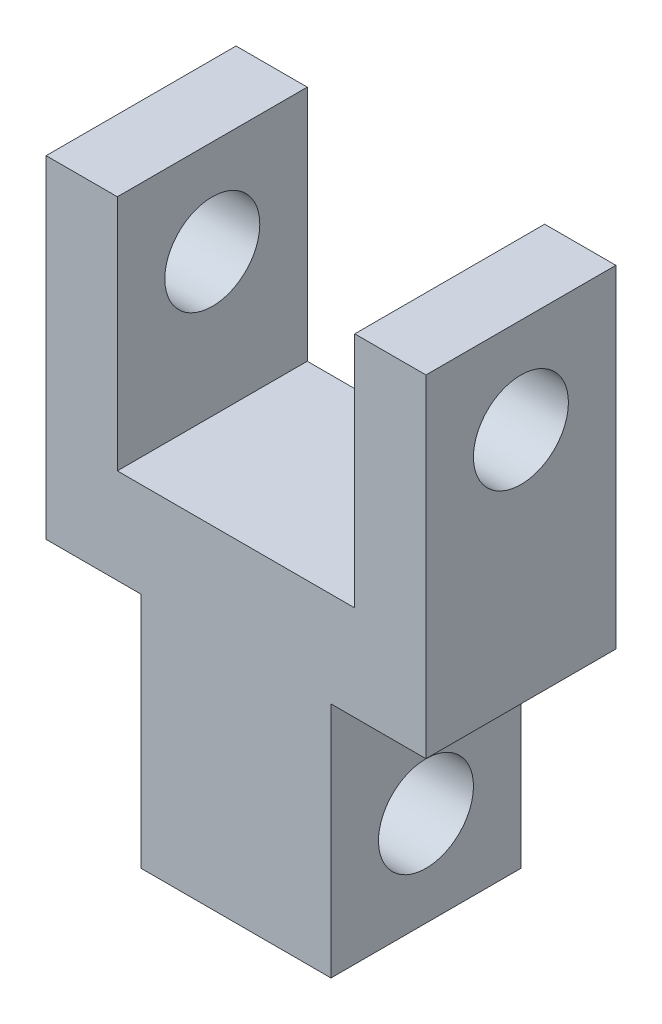
ISO-10303-21;
HEADER;
FILE_DESCRIPTION(('STEP AP214'),'2;1');
FILE_NAME('part.step','',(''),(''),'','','');
FILE_SCHEMA(('AUTOMOTIVE_DESIGN { 1 0 10303 214 1 1 1 1 }'));
ENDSEC;
DATA;
#1=APPLICATION_CONTEXT('core data for automotive mechanical design processes');
#2=APPLICATION_PROTOCOL_DEFINITION('international standard','automotive_design',2000,#1);
#3=PRODUCT_CONTEXT('',#1,'mechanical');
#4=PRODUCT('Part','Part','',(#3));
#5=PRODUCT_RELATED_PRODUCT_CATEGORY('part','',(#4));
#6=PRODUCT_DEFINITION_FORMATION('','',#4);
#7=PRODUCT_DEFINITION_CONTEXT('part definition',#1,'design');
#8=PRODUCT_DEFINITION('design','',#6,#7);
#9=PRODUCT_DEFINITION_SHAPE('','',#8);
#10=(LENGTH_UNIT() NAMED_UNIT(*) SI_UNIT(.MILLI.,.METRE.));
#11=(NAMED_UNIT(*) PLANE_ANGLE_UNIT() SI_UNIT($,.RADIAN.));
#12=(NAMED_UNIT(*) SI_UNIT($,.STERADIAN.) SOLID_ANGLE_UNIT());
#13=UNCERTAINTY_MEASURE_WITH_UNIT(LENGTH_MEASURE(1.E-05),#10,'distance_accuracy_value','');
#14=(GEOMETRIC_REPRESENTATION_CONTEXT(3) GLOBAL_UNCERTAINTY_ASSIGNED_CONTEXT((#13)) GLOBAL_UNIT_ASSIGNED_CONTEXT((#10,
#11,#12)) REPRESENTATION_CONTEXT('',''));
#15=CARTESIAN_POINT('',(0.,0.,0.));
#16=DIRECTION('',(0.,0.,1.));
#17=DIRECTION('',(1.,0.,0.));
#18=AXIS2_PLACEMENT_3D('',#15,#16,#17);
#19=CARTESIAN_POINT('',(-12.7,38.1,6.35));
#20=DIRECTION('',(0.,-1.,0.));
#21=DIRECTION('',(1.,0.,0.));
#22=AXIS2_PLACEMENT_3D('',#19,#20,#21);
#23=PLANE('',#22);
#24=DIRECTION('',(-1.,0.,0.));
#25=VECTOR('',#24,1.);
#26=CARTESIAN_POINT('',(-12.7,38.1,-6.35));
#27=LINE('',#26,#25);
#28=CARTESIAN_POINT('',(-7.9375,38.1,-6.35));
#29=VERTEX_POINT('',#28);
#30=CARTESIAN_POINT('',(-12.7,38.1,-6.35));
#31=VERTEX_POINT('',#30);
#32=EDGE_CURVE('E154',#29,#31,#27,.T.);
#33=ORIENTED_EDGE('',*,*,#32,.T.);
#34=DIRECTION('',(0.,0.,-1.));
#35=VECTOR('',#34,1.);
#36=CARTESIAN_POINT('',(-12.7,38.1,6.35));
#37=LINE('',#36,#35);
#38=CARTESIAN_POINT('',(-12.7,38.1,6.35));
#39=VERTEX_POINT('',#38);
#40=EDGE_CURVE('E11',#39,#31,#37,.T.);
#41=ORIENTED_EDGE('',*,*,#40,.F.);
#42=DIRECTION('',(-1.,0.,0.));
#43=VECTOR('',#42,1.);
#44=CARTESIAN_POINT('',(-12.7,38.1,6.35));
#45=LINE('',#44,#43);
#46=CARTESIAN_POINT('',(-7.9375,38.1,6.35));
#47=VERTEX_POINT('',#46);
#48=EDGE_CURVE('E177',#47,#39,#45,.T.);
#49=ORIENTED_EDGE('',*,*,#48,.F.);
#50=DIRECTION('',(0.,0.,-1.));
#51=VECTOR('',#50,1.);
#52=CARTESIAN_POINT('',(-7.9375,38.1,6.35));
#53=LINE('',#52,#51);
#54=EDGE_CURVE('E150',#47,#29,#53,.T.);
#55=ORIENTED_EDGE('',*,*,#54,.T.);
#56=EDGE_LOOP('',(#33,#41,#49,#55));
#57=FACE_BOUND('',#56,.T.);
#58=ADVANCED_FACE('F33',(#57),#23,.F.);
#59=CARTESIAN_POINT('',(-12.7,38.1,6.35));
#60=DIRECTION('',(1.,0.,0.));
#61=DIRECTION('',(0.,1.,0.));
#62=AXIS2_PLACEMENT_3D('',#59,#60,#61);
#63=PLANE('',#62);
#64=CARTESIAN_POINT('',(-12.7,31.75,0.));
#65=DIRECTION('',(1.,0.,0.));
#66=DIRECTION('',(0.,1.,0.));
#67=AXIS2_PLACEMENT_3D('',#64,#65,#66);
#68=CIRCLE('',#67,3.175);
#69=CARTESIAN_POINT('',(-12.7,34.925,0.));
#70=VERTEX_POINT('',#69);
#71=EDGE_CURVE('E295',#70,#70,#68,.T.);
#72=ORIENTED_EDGE('',*,*,#71,.T.);
#73=EDGE_LOOP('',(#72));
#74=FACE_BOUND('',#73,.T.);
#75=DIRECTION('',(0.,-1.,0.));
#76=VECTOR('',#75,1.);
#77=CARTESIAN_POINT('',(-12.7,38.1,-6.35));
#78=LINE('',#77,#76);
#79=CARTESIAN_POINT('',(-12.7,15.875,-6.35));
#80=VERTEX_POINT('',#79);
#81=EDGE_CURVE('E157',#31,#80,#78,.T.);
#82=ORIENTED_EDGE('',*,*,#81,.T.);
#83=DIRECTION('',(0.,0.,-1.));
#84=VECTOR('',#83,1.);
#85=CARTESIAN_POINT('',(-12.7,15.875,6.35));
#86=LINE('',#85,#84);
#87=CARTESIAN_POINT('',(-12.7,15.875,6.35));
#88=VERTEX_POINT('',#87);
#89=EDGE_CURVE('E42',#88,#80,#86,.T.);
#90=ORIENTED_EDGE('',*,*,#89,.F.);
#91=DIRECTION('',(0.,-1.,0.));
#92=VECTOR('',#91,1.);
#93=CARTESIAN_POINT('',(-12.7,38.1,6.35));
#94=LINE('',#93,#92);
#95=EDGE_CURVE('E105',#39,#88,#94,.T.);
#96=ORIENTED_EDGE('',*,*,#95,.F.);
#97=ORIENTED_EDGE('',*,*,#40,.T.);
#98=EDGE_LOOP('',(#82,#90,#96,#97));
#99=FACE_BOUND('',#98,.T.);
#100=ADVANCED_FACE('F258',(#74,#99),#63,.F.);
#101=CARTESIAN_POINT('',(-12.7,15.875,6.35));
#102=DIRECTION('',(0.,1.,0.));
#103=DIRECTION('',(0.,0.,1.));
#104=AXIS2_PLACEMENT_3D('',#101,#102,#103);
#105=PLANE('',#104);
#106=DIRECTION('',(1.,0.,0.));
#107=VECTOR('',#106,1.);
#108=CARTESIAN_POINT('',(-12.7,15.875,-6.35));
#109=LINE('',#108,#107);
#110=CARTESIAN_POINT('',(-6.35,15.875,-6.35));
#111=VERTEX_POINT('',#110);
#112=EDGE_CURVE('E160',#80,#111,#109,.T.);
#113=ORIENTED_EDGE('',*,*,#112,.T.);
#114=DIRECTION('',(0.,0.,-1.));
#115=VECTOR('',#114,1.);
#116=CARTESIAN_POINT('',(-6.35,15.875,6.35));
#117=LINE('',#116,#115);
#118=CARTESIAN_POINT('',(-6.35,15.875,6.35));
#119=VERTEX_POINT('',#118);
#120=EDGE_CURVE('E196',#119,#111,#117,.T.);
#121=ORIENTED_EDGE('',*,*,#120,.F.);
#122=DIRECTION('',(1.,0.,0.));
#123=VECTOR('',#122,1.);
#124=CARTESIAN_POINT('',(-12.7,15.875,6.35));
#125=LINE('',#124,#123);
#126=EDGE_CURVE('E205',#88,#119,#125,.T.);
#127=ORIENTED_EDGE('',*,*,#126,.F.);
#128=ORIENTED_EDGE('',*,*,#89,.T.);
#129=EDGE_LOOP('',(#113,#121,#127,#128));
#130=FACE_BOUND('',#129,.T.);
#131=ADVANCED_FACE('F203',(#130),#105,.F.);
#132=CARTESIAN_POINT('',(-6.35,15.875,6.35));
#133=DIRECTION('',(1.,0.,0.));
#134=DIRECTION('',(0.,1.,0.));
#135=AXIS2_PLACEMENT_3D('',#132,#133,#134);
#136=PLANE('',#135);
#137=CARTESIAN_POINT('',(-6.35,6.35,0.));
#138=DIRECTION('',(1.,0.,0.));
#139=DIRECTION('',(0.,1.,0.));
#140=AXIS2_PLACEMENT_3D('',#137,#138,#139);
#141=CIRCLE('',#140,3.175);
#142=CARTESIAN_POINT('',(-6.35,9.525,0.));
#143=VERTEX_POINT('',#142);
#144=EDGE_CURVE('E302',#143,#143,#141,.T.);
#145=ORIENTED_EDGE('',*,*,#144,.T.);
#146=EDGE_LOOP('',(#145));
#147=FACE_BOUND('',#146,.T.);
#148=DIRECTION('',(0.,-1.,0.));
#149=VECTOR('',#148,1.);
#150=CARTESIAN_POINT('',(-6.35,15.875,-6.35));
#151=LINE('',#150,#149);
#152=CARTESIAN_POINT('',(-6.35,0.,-6.35));
#153=VERTEX_POINT('',#152);
#154=EDGE_CURVE('E162',#111,#153,#151,.T.);
#155=ORIENTED_EDGE('',*,*,#154,.T.);
#156=DIRECTION('',(0.,0.,-1.));
#157=VECTOR('',#156,1.);
#158=CARTESIAN_POINT('',(-6.35,0.,6.35));
#159=LINE('',#158,#157);
#160=CARTESIAN_POINT('',(-6.35,0.,6.35));
#161=VERTEX_POINT('',#160);
#162=EDGE_CURVE('E193',#161,#153,#159,.T.);
#163=ORIENTED_EDGE('',*,*,#162,.F.);
#164=DIRECTION('',(0.,-1.,0.));
#165=VECTOR('',#164,1.);
#166=CARTESIAN_POINT('',(-6.35,15.875,6.35));
#167=LINE('',#166,#165);
#168=EDGE_CURVE('E223',#119,#161,#167,.T.);
#169=ORIENTED_EDGE('',*,*,#168,.F.);
#170=ORIENTED_EDGE('',*,*,#120,.T.);
#171=EDGE_LOOP('',(#155,#163,#169,#170));
#172=FACE_BOUND('',#171,.T.);
#173=ADVANCED_FACE('F214',(#147,#172),#136,.F.);
#174=CARTESIAN_POINT('',(-6.35,0.,6.35));
#175=DIRECTION('',(0.,1.,0.));
#176=DIRECTION('',(0.,0.,1.));
#177=AXIS2_PLACEMENT_3D('',#174,#175,#176);
#178=PLANE('',#177);
#179=DIRECTION('',(1.,0.,0.));
#180=VECTOR('',#179,1.);
#181=CARTESIAN_POINT('',(-6.35,0.,-6.35));
#182=LINE('',#181,#180);
#183=CARTESIAN_POINT('',(6.35,0.,-6.35));
#184=VERTEX_POINT('',#183);
#185=EDGE_CURVE('E164',#153,#184,#182,.T.);
#186=ORIENTED_EDGE('',*,*,#185,.T.);
#187=DIRECTION('',(0.,0.,-1.));
#188=VECTOR('',#187,1.);
#189=CARTESIAN_POINT('',(6.35,0.,6.35));
#190=LINE('',#189,#188);
#191=CARTESIAN_POINT('',(6.35,0.,6.35));
#192=VERTEX_POINT('',#191);
#193=EDGE_CURVE('E190',#192,#184,#190,.T.);
#194=ORIENTED_EDGE('',*,*,#193,.F.);
#195=DIRECTION('',(1.,0.,0.));
#196=VECTOR('',#195,1.);
#197=CARTESIAN_POINT('',(-6.35,0.,6.35));
#198=LINE('',#197,#196);
#199=EDGE_CURVE('E220',#161,#192,#198,.T.);
#200=ORIENTED_EDGE('',*,*,#199,.F.);
#201=ORIENTED_EDGE('',*,*,#162,.T.);
#202=EDGE_LOOP('',(#186,#194,#200,#201));
#203=FACE_BOUND('',#202,.T.);
#204=ADVANCED_FACE('F218',(#203),#178,.F.);
#205=CARTESIAN_POINT('',(6.35,15.875,6.35));
#206=DIRECTION('',(-1.,0.,0.));
#207=DIRECTION('',(0.,-1.,0.));
#208=AXIS2_PLACEMENT_3D('',#205,#206,#207);
#209=PLANE('',#208);
#210=CARTESIAN_POINT('',(6.35,6.35,0.));
#211=DIRECTION('',(1.,0.,0.));
#212=DIRECTION('',(0.,1.,0.));
#213=AXIS2_PLACEMENT_3D('',#210,#211,#212);
#214=CIRCLE('',#213,3.175);
#215=CARTESIAN_POINT('',(6.35,9.525,0.));
#216=VERTEX_POINT('',#215);
#217=EDGE_CURVE('E306',#216,#216,#214,.T.);
#218=ORIENTED_EDGE('',*,*,#217,.F.);
#219=EDGE_LOOP('',(#218));
#220=FACE_BOUND('',#219,.T.);
#221=DIRECTION('',(0.,1.,0.));
#222=VECTOR('',#221,1.);
#223=CARTESIAN_POINT('',(6.35,15.875,-6.35));
#224=LINE('',#223,#222);
#225=CARTESIAN_POINT('',(6.35,15.875,-6.35));
#226=VERTEX_POINT('',#225);
#227=EDGE_CURVE('E166',#184,#226,#224,.T.);
#228=ORIENTED_EDGE('',*,*,#227,.T.);
#229=DIRECTION('',(0.,0.,-1.));
#230=VECTOR('',#229,1.);
#231=CARTESIAN_POINT('',(6.35,15.875,6.35));
#232=LINE('',#231,#230);
#233=CARTESIAN_POINT('',(6.35,15.875,6.35));
#234=VERTEX_POINT('',#233);
#235=EDGE_CURVE('E187',#234,#226,#232,.T.);
#236=ORIENTED_EDGE('',*,*,#235,.F.);
#237=DIRECTION('',(0.,1.,0.));
#238=VECTOR('',#237,1.);
#239=CARTESIAN_POINT('',(6.35,15.875,6.35));
#240=LINE('',#239,#238);
#241=EDGE_CURVE('E222',#192,#234,#240,.T.);
#242=ORIENTED_EDGE('',*,*,#241,.F.);
#243=ORIENTED_EDGE('',*,*,#193,.T.);
#244=EDGE_LOOP('',(#228,#236,#242,#243));
#245=FACE_BOUND('',#244,.T.);
#246=ADVANCED_FACE('F274',(#220,#245),#209,.F.);
#247=CARTESIAN_POINT('',(12.7,15.875,6.35));
#248=DIRECTION('',(0.,1.,0.));
#249=DIRECTION('',(-1.,0.,0.));
#250=AXIS2_PLACEMENT_3D('',#247,#248,#249);
#251=PLANE('',#250);
#252=DIRECTION('',(1.,0.,0.));
#253=VECTOR('',#252,1.);
#254=CARTESIAN_POINT('',(12.7,15.875,-6.35));
#255=LINE('',#254,#253);
#256=CARTESIAN_POINT('',(12.7,15.875,-6.35));
#257=VERTEX_POINT('',#256);
#258=EDGE_CURVE('E168',#226,#257,#255,.T.);
#259=ORIENTED_EDGE('',*,*,#258,.T.);
#260=DIRECTION('',(0.,0.,-1.));
#261=VECTOR('',#260,1.);
#262=CARTESIAN_POINT('',(12.7,15.875,6.35));
#263=LINE('',#262,#261);
#264=CARTESIAN_POINT('',(12.7,15.875,6.35));
#265=VERTEX_POINT('',#264);
#266=EDGE_CURVE('E184',#265,#257,#263,.T.);
#267=ORIENTED_EDGE('',*,*,#266,.F.);
#268=DIRECTION('',(1.,0.,0.));
#269=VECTOR('',#268,1.);
#270=CARTESIAN_POINT('',(12.7,15.875,6.35));
#271=LINE('',#270,#269);
#272=EDGE_CURVE('E225',#234,#265,#271,.T.);
#273=ORIENTED_EDGE('',*,*,#272,.F.);
#274=ORIENTED_EDGE('',*,*,#235,.T.);
#275=EDGE_LOOP('',(#259,#267,#273,#274));
#276=FACE_BOUND('',#275,.T.);
#277=ADVANCED_FACE('F277',(#276),#251,.F.);
#278=CARTESIAN_POINT('',(12.7,38.1,6.35));
#279=DIRECTION('',(-1.,0.,0.));
#280=DIRECTION('',(0.,-1.,0.));
#281=AXIS2_PLACEMENT_3D('',#278,#279,#280);
#282=PLANE('',#281);
#283=CARTESIAN_POINT('',(12.7,31.75,0.));
#284=DIRECTION('',(1.,0.,0.));
#285=DIRECTION('',(0.,1.,0.));
#286=AXIS2_PLACEMENT_3D('',#283,#284,#285);
#287=CIRCLE('',#286,3.175);
#288=CARTESIAN_POINT('',(12.7,34.925,0.));
#289=VERTEX_POINT('',#288);
#290=EDGE_CURVE('E298',#289,#289,#287,.T.);
#291=ORIENTED_EDGE('',*,*,#290,.F.);
#292=EDGE_LOOP('',(#291));
#293=FACE_BOUND('',#292,.T.);
#294=DIRECTION('',(0.,1.,0.));
#295=VECTOR('',#294,1.);
#296=CARTESIAN_POINT('',(12.7,38.1,-6.35));
#297=LINE('',#296,#295);
#298=CARTESIAN_POINT('',(12.7,38.1,-6.35));
#299=VERTEX_POINT('',#298);
#300=EDGE_CURVE('E170',#257,#299,#297,.T.);
#301=ORIENTED_EDGE('',*,*,#300,.T.);
#302=DIRECTION('',(0.,0.,-1.));
#303=VECTOR('',#302,1.);
#304=CARTESIAN_POINT('',(12.7,38.1,6.35));
#305=LINE('',#304,#303);
#306=CARTESIAN_POINT('',(12.7,38.1,6.35));
#307=VERTEX_POINT('',#306);
#308=EDGE_CURVE('E181',#307,#299,#305,.T.);
#309=ORIENTED_EDGE('',*,*,#308,.F.);
#310=DIRECTION('',(0.,1.,0.));
#311=VECTOR('',#310,1.);
#312=CARTESIAN_POINT('',(12.7,38.1,6.35));
#313=LINE('',#312,#311);
#314=EDGE_CURVE('E231',#265,#307,#313,.T.);
#315=ORIENTED_EDGE('',*,*,#314,.F.);
#316=ORIENTED_EDGE('',*,*,#266,.T.);
#317=EDGE_LOOP('',(#301,#309,#315,#316));
#318=FACE_BOUND('',#317,.T.);
#319=ADVANCED_FACE('F237',(#293,#318),#282,.F.);
#320=CARTESIAN_POINT('',(12.7,38.1,6.35));
#321=DIRECTION('',(0.,-1.,0.));
#322=DIRECTION('',(1.,0.,0.));
#323=AXIS2_PLACEMENT_3D('',#320,#321,#322);
#324=PLANE('',#323);
#325=DIRECTION('',(-1.,0.,0.));
#326=VECTOR('',#325,1.);
#327=CARTESIAN_POINT('',(12.7,38.1,-6.35));
#328=LINE('',#327,#326);
#329=CARTESIAN_POINT('',(7.9375,38.1,-6.35));
#330=VERTEX_POINT('',#329);
#331=EDGE_CURVE('E172',#299,#330,#328,.T.);
#332=ORIENTED_EDGE('',*,*,#331,.T.);
#333=DIRECTION('',(0.,0.,-1.));
#334=VECTOR('',#333,1.);
#335=CARTESIAN_POINT('',(7.9375,38.1,6.35));
#336=LINE('',#335,#334);
#337=CARTESIAN_POINT('',(7.9375,38.1,6.35));
#338=VERTEX_POINT('',#337);
#339=EDGE_CURVE('E145',#338,#330,#336,.T.);
#340=ORIENTED_EDGE('',*,*,#339,.F.);
#341=DIRECTION('',(-1.,0.,0.));
#342=VECTOR('',#341,1.);
#343=CARTESIAN_POINT('',(12.7,38.1,6.35));
#344=LINE('',#343,#342);
#345=EDGE_CURVE('E136',#307,#338,#344,.T.);
#346=ORIENTED_EDGE('',*,*,#345,.F.);
#347=ORIENTED_EDGE('',*,*,#308,.T.);
#348=EDGE_LOOP('',(#332,#340,#346,#347));
#349=FACE_BOUND('',#348,.T.);
#350=ADVANCED_FACE('F241',(#349),#324,.F.);
#351=CARTESIAN_POINT('',(7.9375,38.1,6.35));
#352=DIRECTION('',(1.,0.,0.));
#353=DIRECTION('',(0.,1.,0.));
#354=AXIS2_PLACEMENT_3D('',#351,#352,#353);
#355=PLANE('',#354);
#356=CARTESIAN_POINT('',(7.9375,31.75,0.));
#357=DIRECTION('',(1.,0.,0.));
#358=DIRECTION('',(0.,1.,0.));
#359=AXIS2_PLACEMENT_3D('',#356,#357,#358);
#360=CIRCLE('',#359,3.175);
#361=CARTESIAN_POINT('',(7.9375,34.925,0.));
#362=VERTEX_POINT('',#361);
#363=EDGE_CURVE('E158',#362,#362,#360,.T.);
#364=ORIENTED_EDGE('',*,*,#363,.T.);
#365=EDGE_LOOP('',(#364));
#366=FACE_BOUND('',#365,.T.);
#367=DIRECTION('',(0.,-1.,0.));
#368=VECTOR('',#367,1.);
#369=CARTESIAN_POINT('',(7.9375,38.1,-6.35));
#370=LINE('',#369,#368);
#371=CARTESIAN_POINT('',(7.9375,22.225,-6.35));
#372=VERTEX_POINT('',#371);
#373=EDGE_CURVE('E144',#330,#372,#370,.T.);
#374=ORIENTED_EDGE('',*,*,#373,.T.);
#375=DIRECTION('',(0.,0.,-1.));
#376=VECTOR('',#375,1.);
#377=CARTESIAN_POINT('',(7.9375,22.225,6.35));
#378=LINE('',#377,#376);
#379=CARTESIAN_POINT('',(7.9375,22.225,6.35));
#380=VERTEX_POINT('',#379);
#381=EDGE_CURVE('E141',#380,#372,#378,.T.);
#382=ORIENTED_EDGE('',*,*,#381,.F.);
#383=DIRECTION('',(0.,-1.,0.));
#384=VECTOR('',#383,1.);
#385=CARTESIAN_POINT('',(7.9375,38.1,6.35));
#386=LINE('',#385,#384);
#387=EDGE_CURVE('E130',#338,#380,#386,.T.);
#388=ORIENTED_EDGE('',*,*,#387,.F.);
#389=ORIENTED_EDGE('',*,*,#339,.T.);
#390=EDGE_LOOP('',(#374,#382,#388,#389));
#391=FACE_BOUND('',#390,.T.);
#392=ADVANCED_FACE('F142',(#366,#391),#355,.F.);
#393=CARTESIAN_POINT('',(-7.9375,22.225,6.35));
#394=DIRECTION('',(0.,-1.,0.));
#395=DIRECTION('',(1.,0.,0.));
#396=AXIS2_PLACEMENT_3D('',#393,#394,#395);
#397=PLANE('',#396);
#398=DIRECTION('',(-1.,0.,0.));
#399=VECTOR('',#398,1.);
#400=CARTESIAN_POINT('',(-7.9375,22.225,-6.35));
#401=LINE('',#400,#399);
#402=CARTESIAN_POINT('',(-7.9375,22.225,-6.35));
#403=VERTEX_POINT('',#402);
#404=EDGE_CURVE('E91',#372,#403,#401,.T.);
#405=ORIENTED_EDGE('',*,*,#404,.T.);
#406=DIRECTION('',(0.,0.,-1.));
#407=VECTOR('',#406,1.);
#408=CARTESIAN_POINT('',(-7.9375,22.225,6.35));
#409=LINE('',#408,#407);
#410=CARTESIAN_POINT('',(-7.9375,22.225,6.35));
#411=VERTEX_POINT('',#410);
#412=EDGE_CURVE('E146',#411,#403,#409,.T.);
#413=ORIENTED_EDGE('',*,*,#412,.F.);
#414=DIRECTION('',(-1.,0.,0.));
#415=VECTOR('',#414,1.);
#416=CARTESIAN_POINT('',(-7.9375,22.225,6.35));
#417=LINE('',#416,#415);
#418=EDGE_CURVE('E134',#380,#411,#417,.T.);
#419=ORIENTED_EDGE('',*,*,#418,.F.);
#420=ORIENTED_EDGE('',*,*,#381,.T.);
#421=EDGE_LOOP('',(#405,#413,#419,#420));
#422=FACE_BOUND('',#421,.T.);
#423=ADVANCED_FACE('F148',(#422),#397,.F.);
#424=CARTESIAN_POINT('',(-7.9375,38.1,6.35));
#425=DIRECTION('',(-1.,0.,0.));
#426=DIRECTION('',(0.,-1.,0.));
#427=AXIS2_PLACEMENT_3D('',#424,#425,#426);
#428=PLANE('',#427);
#429=CARTESIAN_POINT('',(-7.9375,31.75,0.));
#430=DIRECTION('',(-1.,0.,0.));
#431=DIRECTION('',(0.,-1.,0.));
#432=AXIS2_PLACEMENT_3D('',#429,#430,#431);
#433=CIRCLE('',#432,3.175);
#434=CARTESIAN_POINT('',(-7.9375,28.575,0.));
#435=VERTEX_POINT('',#434);
#436=EDGE_CURVE('E36',#435,#435,#433,.T.);
#437=ORIENTED_EDGE('',*,*,#436,.T.);
#438=EDGE_LOOP('',(#437));
#439=FACE_BOUND('',#438,.T.);
#440=DIRECTION('',(0.,1.,0.));
#441=VECTOR('',#440,1.);
#442=CARTESIAN_POINT('',(-7.9375,38.1,-6.35));
#443=LINE('',#442,#441);
#444=EDGE_CURVE('E97',#403,#29,#443,.T.);
#445=ORIENTED_EDGE('',*,*,#444,.T.);
#446=ORIENTED_EDGE('',*,*,#54,.F.);
#447=DIRECTION('',(0.,1.,0.));
#448=VECTOR('',#447,1.);
#449=CARTESIAN_POINT('',(-7.9375,38.1,6.35));
#450=LINE('',#449,#448);
#451=EDGE_CURVE('E50',#411,#47,#450,.T.);
#452=ORIENTED_EDGE('',*,*,#451,.F.);
#453=ORIENTED_EDGE('',*,*,#412,.T.);
#454=EDGE_LOOP('',(#445,#446,#452,#453));
#455=FACE_BOUND('',#454,.T.);
#456=ADVANCED_FACE('F245',(#439,#455),#428,.F.);
#457=CARTESIAN_POINT('',(0.,0.,6.35));
#458=DIRECTION('',(0.,0.,-1.));
#459=DIRECTION('',(-1.,0.,0.));
#460=AXIS2_PLACEMENT_3D('',#457,#458,#459);
#461=PLANE('',#460);
#462=ORIENTED_EDGE('',*,*,#48,.T.);
#463=ORIENTED_EDGE('',*,*,#95,.T.);
#464=ORIENTED_EDGE('',*,*,#126,.T.);
#465=ORIENTED_EDGE('',*,*,#168,.T.);
#466=ORIENTED_EDGE('',*,*,#199,.T.);
#467=ORIENTED_EDGE('',*,*,#241,.T.);
#468=ORIENTED_EDGE('',*,*,#272,.T.);
#469=ORIENTED_EDGE('',*,*,#314,.T.);
#470=ORIENTED_EDGE('',*,*,#345,.T.);
#471=ORIENTED_EDGE('',*,*,#387,.T.);
#472=ORIENTED_EDGE('',*,*,#418,.T.);
#473=ORIENTED_EDGE('',*,*,#451,.T.);
#474=EDGE_LOOP('',(#462,#463,#464,#465,#466,#467,#468,#469,#470,#471,#472,#473));
#475=FACE_BOUND('',#474,.T.);
#476=ADVANCED_FACE('F132',(#475),#461,.F.);
#477=CARTESIAN_POINT('',(0.,0.,-6.35));
#478=DIRECTION('',(0.,0.,-1.));
#479=DIRECTION('',(-1.,0.,0.));
#480=AXIS2_PLACEMENT_3D('',#477,#478,#479);
#481=PLANE('',#480);
#482=ORIENTED_EDGE('',*,*,#32,.F.);
#483=ORIENTED_EDGE('',*,*,#444,.F.);
#484=ORIENTED_EDGE('',*,*,#404,.F.);
#485=ORIENTED_EDGE('',*,*,#373,.F.);
#486=ORIENTED_EDGE('',*,*,#331,.F.);
#487=ORIENTED_EDGE('',*,*,#300,.F.);
#488=ORIENTED_EDGE('',*,*,#258,.F.);
#489=ORIENTED_EDGE('',*,*,#227,.F.);
#490=ORIENTED_EDGE('',*,*,#185,.F.);
#491=ORIENTED_EDGE('',*,*,#154,.F.);
#492=ORIENTED_EDGE('',*,*,#112,.F.);
#493=ORIENTED_EDGE('',*,*,#81,.F.);
#494=EDGE_LOOP('',(#482,#483,#484,#485,#486,#487,#488,#489,#490,#491,#492,#493));
#495=FACE_BOUND('',#494,.T.);
#496=ADVANCED_FACE('F209',(#495),#481,.T.);
#497=CARTESIAN_POINT('',(-12.7,31.75,0.));
#498=DIRECTION('',(1.,0.,0.));
#499=DIRECTION('',(0.,1.,0.));
#500=AXIS2_PLACEMENT_3D('',#497,#498,#499);
#501=CYLINDRICAL_SURFACE('',#500,3.175);
#502=ORIENTED_EDGE('',*,*,#71,.F.);
#503=EDGE_LOOP('',(#502));
#504=FACE_BOUND('',#503,.T.);
#505=ORIENTED_EDGE('',*,*,#436,.F.);
#506=EDGE_LOOP('',(#505));
#507=FACE_BOUND('',#506,.T.);
#508=ADVANCED_FACE('F322',(#504,#507),#501,.F.);
#509=ORIENTED_EDGE('',*,*,#290,.T.);
#510=EDGE_LOOP('',(#509));
#511=FACE_BOUND('',#510,.T.);
#512=ORIENTED_EDGE('',*,*,#363,.F.);
#513=EDGE_LOOP('',(#512));
#514=FACE_BOUND('',#513,.T.);
#515=ADVANCED_FACE('F316',(#511,#514),#501,.F.);
#516=CARTESIAN_POINT('',(-12.7,6.35,0.));
#517=DIRECTION('',(1.,0.,0.));
#518=DIRECTION('',(0.,1.,0.));
#519=AXIS2_PLACEMENT_3D('',#516,#517,#518);
#520=CYLINDRICAL_SURFACE('',#519,3.175);
#521=ORIENTED_EDGE('',*,*,#217,.T.);
#522=EDGE_LOOP('',(#521));
#523=FACE_BOUND('',#522,.T.);
#524=ORIENTED_EDGE('',*,*,#144,.F.);
#525=EDGE_LOOP('',(#524));
#526=FACE_BOUND('',#525,.T.);
#527=ADVANCED_FACE('F310',(#523,#526),#520,.F.);
#528=CLOSED_SHELL('',(#58,#100,#131,#173,#204,#246,#277,#319,#350,#392,#423,#456,#476,#496,#508,
#515,#527));
#529=MANIFOLD_SOLID_BREP('B2',#528);
#530=ADVANCED_BREP_SHAPE_REPRESENTATION('',(#18,#529),#14);
#531=SHAPE_DEFINITION_REPRESENTATION(#9,#530);
ENDSEC;
END-ISO-10303-21;
